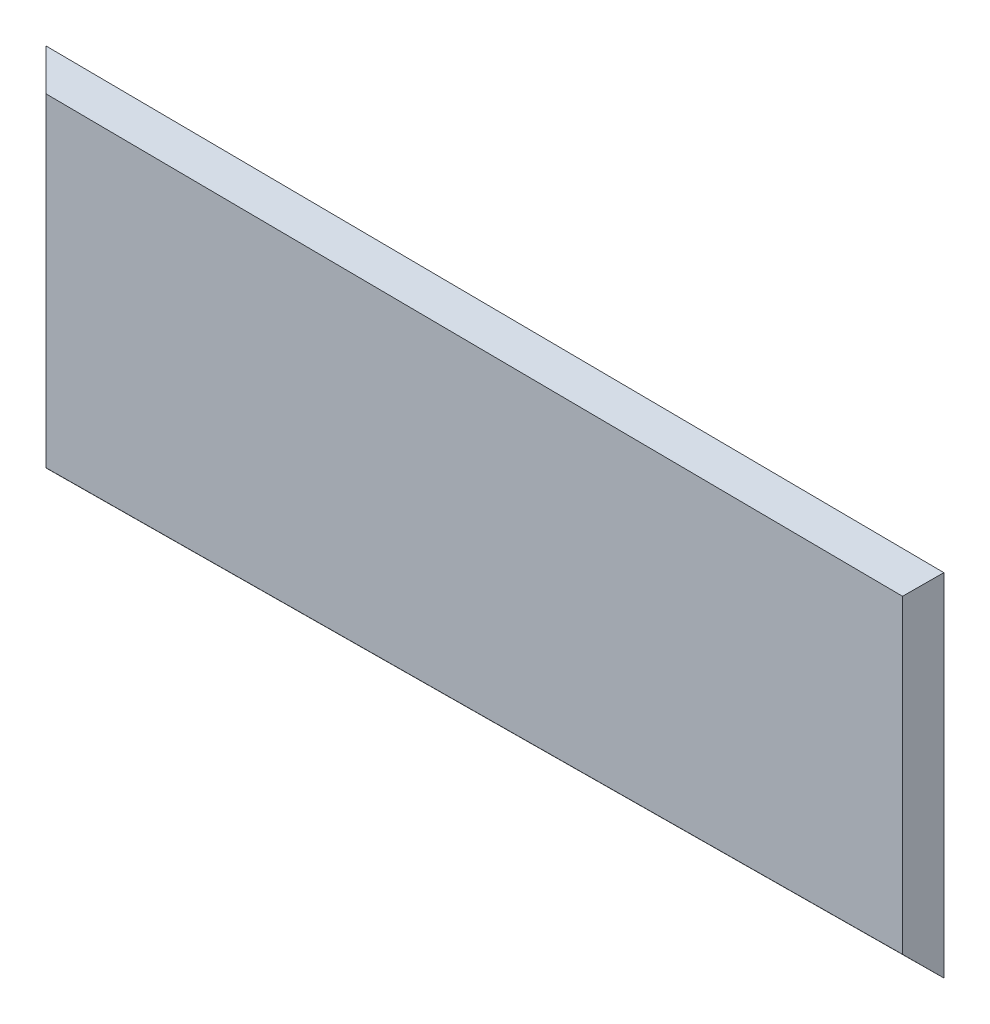
ISO-10303-21;
HEADER;
FILE_DESCRIPTION(('STEP AP214'),'2;1');
FILE_NAME('part.step','',(''),(''),'','','');
FILE_SCHEMA(('AUTOMOTIVE_DESIGN { 1 0 10303 214 1 1 1 1 }'));
ENDSEC;
DATA;
#1=APPLICATION_CONTEXT('core data for automotive mechanical design processes');
#2=APPLICATION_PROTOCOL_DEFINITION('international standard','automotive_design',2000,#1);
#3=PRODUCT_CONTEXT('',#1,'mechanical');
#4=PRODUCT('Part','Part','',(#3));
#5=PRODUCT_RELATED_PRODUCT_CATEGORY('part','',(#4));
#6=PRODUCT_DEFINITION_FORMATION('','',#4);
#7=PRODUCT_DEFINITION_CONTEXT('part definition',#1,'design');
#8=PRODUCT_DEFINITION('design','',#6,#7);
#9=PRODUCT_DEFINITION_SHAPE('','',#8);
#10=(LENGTH_UNIT() NAMED_UNIT(*) SI_UNIT(.MILLI.,.METRE.));
#11=(NAMED_UNIT(*) PLANE_ANGLE_UNIT() SI_UNIT($,.RADIAN.));
#12=(NAMED_UNIT(*) SI_UNIT($,.STERADIAN.) SOLID_ANGLE_UNIT());
#13=UNCERTAINTY_MEASURE_WITH_UNIT(LENGTH_MEASURE(1.E-05),#10,'distance_accuracy_value','');
#14=(GEOMETRIC_REPRESENTATION_CONTEXT(3) GLOBAL_UNCERTAINTY_ASSIGNED_CONTEXT((#13)) GLOBAL_UNIT_ASSIGNED_CONTEXT((#10,
#11,#12)) REPRESENTATION_CONTEXT('',''));
#15=CARTESIAN_POINT('',(0.,0.,0.));
#16=DIRECTION('',(0.,0.,1.));
#17=DIRECTION('',(1.,0.,0.));
#18=AXIS2_PLACEMENT_3D('',#15,#16,#17);
#19=CARTESIAN_POINT('',(0.,0.,10.));
#20=DIRECTION('',(0.,0.,-1.));
#21=DIRECTION('',(-1.,0.,0.));
#22=AXIS2_PLACEMENT_3D('',#19,#20,#21);
#23=PLANE('',#22);
#24=DIRECTION('',(-0.999967590149138,0.00805100312543103,0.));
#25=VECTOR('',#24,1.);
#26=CARTESIAN_POINT('',(0.603803055203428,74.9948145131459,10.));
#27=LINE('',#26,#25);
#28=CARTESIAN_POINT('',(-10.,75.080188531644,10.));
#29=VERTEX_POINT('',#28);
#30=CARTESIAN_POINT('',(-424.714346895075,78.41916325033,10.));
#31=VERTEX_POINT('',#30);
#32=EDGE_CURVE('E42',#29,#31,#27,.T.);
#33=ORIENTED_EDGE('',*,*,#32,.T.);
#34=DIRECTION('',(0.,-1.,0.));
#35=VECTOR('',#34,1.);
#36=CARTESIAN_POINT('',(-424.714346895075,0.,10.));
#37=LINE('',#36,#35);
#38=CARTESIAN_POINT('',(-424.714346895075,-78.41916325033,10.));
#39=VERTEX_POINT('',#38);
#40=EDGE_CURVE('E11',#31,#39,#37,.T.);
#41=ORIENTED_EDGE('',*,*,#40,.T.);
#42=DIRECTION('',(0.999967590149138,0.00805100312543103,0.));
#43=VECTOR('',#42,1.);
#44=CARTESIAN_POINT('',(0.603803055203428,-74.9948145131459,10.));
#45=LINE('',#44,#43);
#46=CARTESIAN_POINT('',(-10.,-75.080188531644,10.));
#47=VERTEX_POINT('',#46);
#48=EDGE_CURVE('E98',#39,#47,#45,.T.);
#49=ORIENTED_EDGE('',*,*,#48,.T.);
#50=DIRECTION('',(0.,1.,0.));
#51=VECTOR('',#50,1.);
#52=CARTESIAN_POINT('',(-10.,0.,10.));
#53=LINE('',#52,#51);
#54=EDGE_CURVE('E53',#47,#29,#53,.T.);
#55=ORIENTED_EDGE('',*,*,#54,.T.);
#56=EDGE_LOOP('',(#33,#41,#49,#55));
#57=FACE_BOUND('',#56,.T.);
#58=ADVANCED_FACE('F33',(#57),#23,.F.);
#59=CARTESIAN_POINT('',(0.,0.,0.));
#60=DIRECTION('',(0.,0.,-1.));
#61=DIRECTION('',(-1.,0.,0.));
#62=AXIS2_PLACEMENT_3D('',#59,#60,#61);
#63=PLANE('',#62);
#64=DIRECTION('',(-0.999967590149138,0.00805100312543103,0.));
#65=VECTOR('',#64,1.);
#66=CARTESIAN_POINT('',(-434.714346895075,88.5,0.));
#67=LINE('',#66,#65);
#68=CARTESIAN_POINT('',(0.,85.,0.));
#69=VERTEX_POINT('',#68);
#70=CARTESIAN_POINT('',(-434.714346895075,88.5,0.));
#71=VERTEX_POINT('',#70);
#72=EDGE_CURVE('E85',#69,#71,#67,.T.);
#73=ORIENTED_EDGE('',*,*,#72,.F.);
#74=DIRECTION('',(0.,1.,0.));
#75=VECTOR('',#74,1.);
#76=CARTESIAN_POINT('',(0.,85.,0.));
#77=LINE('',#76,#75);
#78=CARTESIAN_POINT('',(0.,-85.,0.));
#79=VERTEX_POINT('',#78);
#80=EDGE_CURVE('E94',#79,#69,#77,.T.);
#81=ORIENTED_EDGE('',*,*,#80,.F.);
#82=DIRECTION('',(0.999967590149138,0.00805100312543103,0.));
#83=VECTOR('',#82,1.);
#84=CARTESIAN_POINT('',(-434.714346895075,-88.5,0.));
#85=LINE('',#84,#83);
#86=CARTESIAN_POINT('',(-434.714346895075,-88.5,0.));
#87=VERTEX_POINT('',#86);
#88=EDGE_CURVE('E92',#87,#79,#85,.T.);
#89=ORIENTED_EDGE('',*,*,#88,.F.);
#90=DIRECTION('',(0.,-1.,0.));
#91=VECTOR('',#90,1.);
#92=CARTESIAN_POINT('',(-434.714346895075,-88.5,0.));
#93=LINE('',#92,#91);
#94=EDGE_CURVE('E78',#71,#87,#93,.T.);
#95=ORIENTED_EDGE('',*,*,#94,.F.);
#96=EDGE_LOOP('',(#73,#81,#89,#95));
#97=FACE_BOUND('',#96,.T.);
#98=ADVANCED_FACE('F90',(#97),#63,.T.);
#99=CARTESIAN_POINT('',(-10.,0.,10.));
#100=DIRECTION('',(-0.707106781186548,0.,-0.707106781186547));
#101=DIRECTION('',(0.,1.,0.));
#102=AXIS2_PLACEMENT_3D('',#99,#100,#101);
#103=PLANE('',#102);
#104=DIRECTION('',(-0.578893476045663,0.57425141426342,0.578893476045663));
#105=VECTOR('',#104,1.);
#106=CARTESIAN_POINT('',(-6.4748592878958,-78.577061657994,6.47485928789575));
#107=LINE('',#106,#105);
#108=EDGE_CURVE('E81',#79,#47,#107,.T.);
#109=ORIENTED_EDGE('',*,*,#108,.F.);
#110=ORIENTED_EDGE('',*,*,#80,.T.);
#111=DIRECTION('',(-0.578893476045663,-0.57425141426342,0.578893476045663));
#112=VECTOR('',#111,1.);
#113=CARTESIAN_POINT('',(-34.9589369049672,50.3213936768574,34.9589369049672));
#114=LINE('',#113,#112);
#115=EDGE_CURVE('E37',#29,#69,#114,.F.);
#116=ORIENTED_EDGE('',*,*,#115,.F.);
#117=ORIENTED_EDGE('',*,*,#54,.F.);
#118=EDGE_LOOP('',(#109,#110,#116,#117));
#119=FACE_BOUND('',#118,.T.);
#120=ADVANCED_FACE('F35',(#119),#103,.F.);
#121=CARTESIAN_POINT('',(0.603803055203428,74.9948145131459,10.));
#122=DIRECTION('',(-0.00569291890534638,-0.707083863961227,-0.707106781186547));
#123=DIRECTION('',(-0.999967590149138,0.00805100312543104,0.));
#124=AXIS2_PLACEMENT_3D('',#121,#122,#123);
#125=PLANE('',#124);
#126=ORIENTED_EDGE('',*,*,#115,.T.);
#127=ORIENTED_EDGE('',*,*,#72,.T.);
#128=DIRECTION('',(0.575794587701306,-0.580449123996036,0.575794587701306));
#129=VECTOR('',#128,1.);
#130=CARTESIAN_POINT('',(-282.560135578447,-64.88417650577,152.154211316627));
#131=LINE('',#130,#129);
#132=EDGE_CURVE('E74',#31,#71,#131,.F.);
#133=ORIENTED_EDGE('',*,*,#132,.F.);
#134=ORIENTED_EDGE('',*,*,#32,.F.);
#135=EDGE_LOOP('',(#126,#127,#133,#134));
#136=FACE_BOUND('',#135,.T.);
#137=ADVANCED_FACE('F86',(#136),#125,.F.);
#138=CARTESIAN_POINT('',(0.603803055203428,-74.9948145131459,10.));
#139=DIRECTION('',(-0.00569291890534638,0.707083863961227,-0.707106781186547));
#140=DIRECTION('',(0.999967590149138,0.00805100312543104,0.));
#141=AXIS2_PLACEMENT_3D('',#138,#139,#140);
#142=PLANE('',#141);
#143=ORIENTED_EDGE('',*,*,#108,.T.);
#144=ORIENTED_EDGE('',*,*,#48,.F.);
#145=DIRECTION('',(-0.575794587701306,-0.580449123996036,-0.575794587701306));
#146=VECTOR('',#145,1.);
#147=CARTESIAN_POINT('',(-282.560135578447,64.88417650577,152.154211316627));
#148=LINE('',#147,#146);
#149=EDGE_CURVE('E82',#87,#39,#148,.F.);
#150=ORIENTED_EDGE('',*,*,#149,.F.);
#151=ORIENTED_EDGE('',*,*,#88,.T.);
#152=EDGE_LOOP('',(#143,#144,#150,#151));
#153=FACE_BOUND('',#152,.T.);
#154=ADVANCED_FACE('F106',(#153),#142,.F.);
#155=CARTESIAN_POINT('',(-424.714346895075,0.,10.));
#156=DIRECTION('',(0.707106781186547,0.,-0.707106781186548));
#157=DIRECTION('',(0.,-1.,0.));
#158=AXIS2_PLACEMENT_3D('',#155,#156,#157);
#159=PLANE('',#158);
#160=ORIENTED_EDGE('',*,*,#132,.T.);
#161=ORIENTED_EDGE('',*,*,#94,.T.);
#162=ORIENTED_EDGE('',*,*,#149,.T.);
#163=ORIENTED_EDGE('',*,*,#40,.F.);
#164=EDGE_LOOP('',(#160,#161,#162,#163));
#165=FACE_BOUND('',#164,.T.);
#166=ADVANCED_FACE('F76',(#165),#159,.F.);
#167=CLOSED_SHELL('',(#58,#98,#120,#137,#154,#166));
#168=MANIFOLD_SOLID_BREP('B2',#167);
#169=ADVANCED_BREP_SHAPE_REPRESENTATION('',(#18,#168),#14);
#170=SHAPE_DEFINITION_REPRESENTATION(#9,#169);
ENDSEC;
END-ISO-10303-21;
